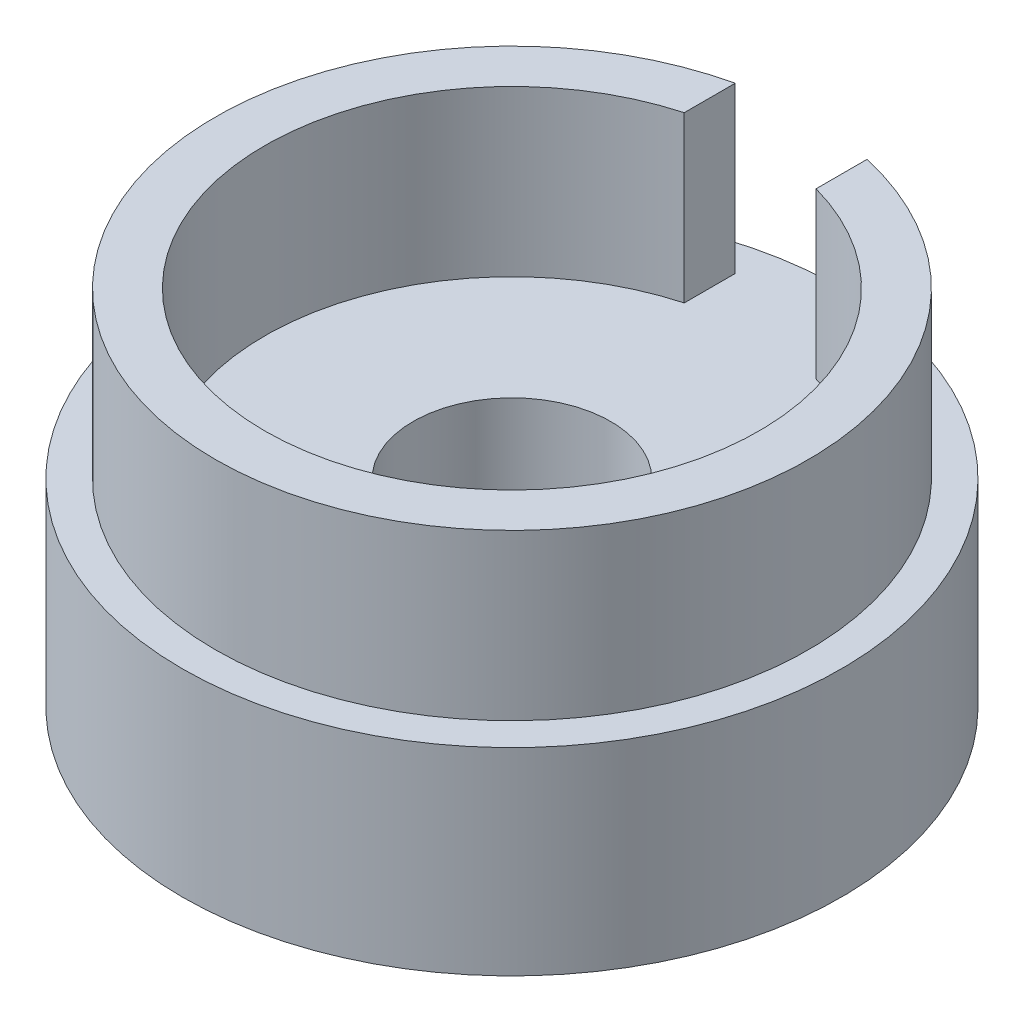
ISO-10303-21;
HEADER;
FILE_DESCRIPTION(('STEP AP214'),'2;1');
FILE_NAME('part.step','',(''),(''),'','','');
FILE_SCHEMA(('AUTOMOTIVE_DESIGN { 1 0 10303 214 1 1 1 1 }'));
ENDSEC;
DATA;
#1=APPLICATION_CONTEXT('core data for automotive mechanical design processes');
#2=APPLICATION_PROTOCOL_DEFINITION('international standard','automotive_design',2000,#1);
#3=PRODUCT_CONTEXT('',#1,'mechanical');
#4=PRODUCT('Part','Part','',(#3));
#5=PRODUCT_RELATED_PRODUCT_CATEGORY('part','',(#4));
#6=PRODUCT_DEFINITION_FORMATION('','',#4);
#7=PRODUCT_DEFINITION_CONTEXT('part definition',#1,'design');
#8=PRODUCT_DEFINITION('design','',#6,#7);
#9=PRODUCT_DEFINITION_SHAPE('','',#8);
#10=(LENGTH_UNIT() NAMED_UNIT(*) SI_UNIT(.MILLI.,.METRE.));
#11=(NAMED_UNIT(*) PLANE_ANGLE_UNIT() SI_UNIT($,.RADIAN.));
#12=(NAMED_UNIT(*) SI_UNIT($,.STERADIAN.) SOLID_ANGLE_UNIT());
#13=UNCERTAINTY_MEASURE_WITH_UNIT(LENGTH_MEASURE(1.E-05),#10,'distance_accuracy_value','');
#14=(GEOMETRIC_REPRESENTATION_CONTEXT(3) GLOBAL_UNCERTAINTY_ASSIGNED_CONTEXT((#13)) GLOBAL_UNIT_ASSIGNED_CONTEXT((#10,
#11,#12)) REPRESENTATION_CONTEXT('',''));
#15=CARTESIAN_POINT('',(0.,0.,0.));
#16=DIRECTION('',(0.,0.,1.));
#17=DIRECTION('',(1.,0.,0.));
#18=AXIS2_PLACEMENT_3D('',#15,#16,#17);
#19=CARTESIAN_POINT('',(0.,3.,0.));
#20=DIRECTION('',(0.,1.,0.));
#21=DIRECTION('',(0.,0.,1.));
#22=AXIS2_PLACEMENT_3D('',#19,#20,#21);
#23=PLANE('',#22);
#24=CARTESIAN_POINT('',(0.,3.,0.));
#25=DIRECTION('',(0.,1.,0.));
#26=DIRECTION('',(0.,0.,1.));
#27=AXIS2_PLACEMENT_3D('',#24,#25,#26);
#28=CIRCLE('',#27,5.);
#29=CARTESIAN_POINT('',(0.,3.,5.));
#30=VERTEX_POINT('',#29);
#31=EDGE_CURVE('E104',#30,#30,#28,.T.);
#32=ORIENTED_EDGE('',*,*,#31,.T.);
#33=EDGE_LOOP('',(#32));
#34=FACE_BOUND('',#33,.T.);
#35=DIRECTION('',(0.,0.,1.));
#36=VECTOR('',#35,1.);
#37=CARTESIAN_POINT('',(1.,3.,-3.61420807370024));
#38=LINE('',#37,#36);
#39=CARTESIAN_POINT('',(1.,3.,-4.38748219369606));
#40=VERTEX_POINT('',#39);
#41=CARTESIAN_POINT('',(1.,3.,-3.61420807370024));
#42=VERTEX_POINT('',#41);
#43=EDGE_CURVE('E137',#40,#42,#38,.T.);
#44=ORIENTED_EDGE('',*,*,#43,.F.);
#45=CARTESIAN_POINT('',(0.,3.,0.));
#46=DIRECTION('',(0.,1.,0.));
#47=DIRECTION('',(0.,0.,1.));
#48=AXIS2_PLACEMENT_3D('',#45,#46,#47);
#49=CIRCLE('',#48,4.5);
#50=CARTESIAN_POINT('',(-1.,3.,-4.38748219369606));
#51=VERTEX_POINT('',#50);
#52=EDGE_CURVE('E88',#51,#40,#49,.T.);
#53=ORIENTED_EDGE('',*,*,#52,.F.);
#54=DIRECTION('',(0.,0.,-1.));
#55=VECTOR('',#54,1.);
#56=CARTESIAN_POINT('',(-1.,3.,-3.61420807370024));
#57=LINE('',#56,#55);
#58=CARTESIAN_POINT('',(-1.,3.,-3.61420807370024));
#59=VERTEX_POINT('',#58);
#60=EDGE_CURVE('E139',#59,#51,#57,.T.);
#61=ORIENTED_EDGE('',*,*,#60,.F.);
#62=CARTESIAN_POINT('',(0.,3.,0.));
#63=DIRECTION('',(0.,1.,0.));
#64=DIRECTION('',(0.,0.,1.));
#65=AXIS2_PLACEMENT_3D('',#62,#63,#64);
#66=CIRCLE('',#65,3.75);
#67=EDGE_CURVE('E40',#42,#59,#66,.F.);
#68=ORIENTED_EDGE('',*,*,#67,.F.);
#69=EDGE_LOOP('',(#44,#53,#61,#68));
#70=FACE_BOUND('',#69,.T.);
#71=CARTESIAN_POINT('',(0.,3.,0.));
#72=DIRECTION('',(0.,1.,0.));
#73=DIRECTION('',(0.,0.,1.));
#74=AXIS2_PLACEMENT_3D('',#71,#72,#73);
#75=CIRCLE('',#74,1.5);
#76=CARTESIAN_POINT('',(0.,3.,1.5));
#77=VERTEX_POINT('',#76);
#78=EDGE_CURVE('E98',#77,#77,#75,.T.);
#79=ORIENTED_EDGE('',*,*,#78,.F.);
#80=EDGE_LOOP('',(#79));
#81=FACE_BOUND('',#80,.T.);
#82=ADVANCED_FACE('F32',(#34,#70,#81),#23,.T.);
#83=CARTESIAN_POINT('',(0.,0.,0.));
#84=DIRECTION('',(0.,1.,0.));
#85=DIRECTION('',(0.,0.,1.));
#86=AXIS2_PLACEMENT_3D('',#83,#84,#85);
#87=PLANE('',#86);
#88=CARTESIAN_POINT('',(0.,0.,0.));
#89=DIRECTION('',(0.,1.,0.));
#90=DIRECTION('',(0.,0.,1.));
#91=AXIS2_PLACEMENT_3D('',#88,#89,#90);
#92=CIRCLE('',#91,5.);
#93=CARTESIAN_POINT('',(0.,0.,5.));
#94=VERTEX_POINT('',#93);
#95=EDGE_CURVE('E101',#94,#94,#92,.T.);
#96=ORIENTED_EDGE('',*,*,#95,.F.);
#97=EDGE_LOOP('',(#96));
#98=FACE_BOUND('',#97,.T.);
#99=CARTESIAN_POINT('',(0.,0.,0.));
#100=DIRECTION('',(0.,1.,0.));
#101=DIRECTION('',(0.,0.,1.));
#102=AXIS2_PLACEMENT_3D('',#99,#100,#101);
#103=CIRCLE('',#102,1.5);
#104=CARTESIAN_POINT('',(0.,0.,1.5));
#105=VERTEX_POINT('',#104);
#106=EDGE_CURVE('E90',#105,#105,#103,.T.);
#107=ORIENTED_EDGE('',*,*,#106,.T.);
#108=EDGE_LOOP('',(#107));
#109=FACE_BOUND('',#108,.T.);
#110=ADVANCED_FACE('F111',(#98,#109),#87,.F.);
#111=CARTESIAN_POINT('',(0.,3.,0.));
#112=DIRECTION('',(0.,-1.,0.));
#113=DIRECTION('',(0.,0.,-1.));
#114=AXIS2_PLACEMENT_3D('',#111,#112,#113);
#115=CYLINDRICAL_SURFACE('',#114,5.);
#116=ORIENTED_EDGE('',*,*,#31,.F.);
#117=EDGE_LOOP('',(#116));
#118=FACE_BOUND('',#117,.T.);
#119=ORIENTED_EDGE('',*,*,#95,.T.);
#120=EDGE_LOOP('',(#119));
#121=FACE_BOUND('',#120,.T.);
#122=ADVANCED_FACE('F34',(#118,#121),#115,.T.);
#123=CARTESIAN_POINT('',(0.,3.,0.));
#124=DIRECTION('',(0.,-1.,0.));
#125=DIRECTION('',(0.,0.,-1.));
#126=AXIS2_PLACEMENT_3D('',#123,#124,#125);
#127=CYLINDRICAL_SURFACE('',#126,1.5);
#128=ORIENTED_EDGE('',*,*,#78,.T.);
#129=EDGE_LOOP('',(#128));
#130=FACE_BOUND('',#129,.T.);
#131=ORIENTED_EDGE('',*,*,#106,.F.);
#132=EDGE_LOOP('',(#131));
#133=FACE_BOUND('',#132,.T.);
#134=ADVANCED_FACE('F116',(#130,#133),#127,.F.);
#135=CARTESIAN_POINT('',(0.,5.5,0.));
#136=DIRECTION('',(0.,-1.,0.));
#137=DIRECTION('',(0.,0.,-1.));
#138=AXIS2_PLACEMENT_3D('',#135,#136,#137);
#139=CYLINDRICAL_SURFACE('',#138,3.75);
#140=DIRECTION('',(0.,1.,0.));
#141=VECTOR('',#140,1.);
#142=CARTESIAN_POINT('',(1.,0.566808831390843,-3.61420807370024));
#143=LINE('',#142,#141);
#144=CARTESIAN_POINT('',(1.,5.5,-3.61420807370024));
#145=VERTEX_POINT('',#144);
#146=EDGE_CURVE('E84',#42,#145,#143,.T.);
#147=ORIENTED_EDGE('',*,*,#146,.F.);
#148=ORIENTED_EDGE('',*,*,#67,.T.);
#149=DIRECTION('',(0.,1.,0.));
#150=VECTOR('',#149,1.);
#151=CARTESIAN_POINT('',(-1.,0.566808831390843,-3.61420807370024));
#152=LINE('',#151,#150);
#153=CARTESIAN_POINT('',(-1.,5.5,-3.61420807370024));
#154=VERTEX_POINT('',#153);
#155=EDGE_CURVE('E72',#59,#154,#152,.T.);
#156=ORIENTED_EDGE('',*,*,#155,.T.);
#157=CARTESIAN_POINT('',(0.,5.5,0.));
#158=DIRECTION('',(0.,1.,0.));
#159=DIRECTION('',(0.,0.,1.));
#160=AXIS2_PLACEMENT_3D('',#157,#158,#159);
#161=CIRCLE('',#160,3.75);
#162=EDGE_CURVE('E82',#154,#145,#161,.T.);
#163=ORIENTED_EDGE('',*,*,#162,.T.);
#164=EDGE_LOOP('',(#147,#148,#156,#163));
#165=FACE_BOUND('',#164,.T.);
#166=ADVANCED_FACE('F81',(#165),#139,.F.);
#167=CARTESIAN_POINT('',(0.,5.5,0.));
#168=DIRECTION('',(0.,-1.,0.));
#169=DIRECTION('',(0.,0.,-1.));
#170=AXIS2_PLACEMENT_3D('',#167,#168,#169);
#171=CYLINDRICAL_SURFACE('',#170,4.5);
#172=ORIENTED_EDGE('',*,*,#52,.T.);
#173=DIRECTION('',(0.,-1.,0.));
#174=VECTOR('',#173,1.);
#175=CARTESIAN_POINT('',(1.,5.5,-4.38748219369606));
#176=LINE('',#175,#174);
#177=CARTESIAN_POINT('',(1.,5.5,-4.38748219369606));
#178=VERTEX_POINT('',#177);
#179=EDGE_CURVE('E93',#40,#178,#176,.F.);
#180=ORIENTED_EDGE('',*,*,#179,.T.);
#181=CARTESIAN_POINT('',(0.,5.5,0.));
#182=DIRECTION('',(0.,1.,0.));
#183=DIRECTION('',(0.,0.,1.));
#184=AXIS2_PLACEMENT_3D('',#181,#182,#183);
#185=CIRCLE('',#184,4.5);
#186=CARTESIAN_POINT('',(-1.,5.5,-4.38748219369606));
#187=VERTEX_POINT('',#186);
#188=EDGE_CURVE('E87',#187,#178,#185,.T.);
#189=ORIENTED_EDGE('',*,*,#188,.F.);
#190=DIRECTION('',(0.,-1.,0.));
#191=VECTOR('',#190,1.);
#192=CARTESIAN_POINT('',(-1.,5.5,-4.38748219369606));
#193=LINE('',#192,#191);
#194=EDGE_CURVE('E46',#187,#51,#193,.T.);
#195=ORIENTED_EDGE('',*,*,#194,.T.);
#196=EDGE_LOOP('',(#172,#180,#189,#195));
#197=FACE_BOUND('',#196,.T.);
#198=ADVANCED_FACE('F124',(#197),#171,.T.);
#199=CARTESIAN_POINT('',(0.,5.5,0.));
#200=DIRECTION('',(0.,1.,0.));
#201=DIRECTION('',(0.,0.,1.));
#202=AXIS2_PLACEMENT_3D('',#199,#200,#201);
#203=PLANE('',#202);
#204=DIRECTION('',(0.,0.,-1.));
#205=VECTOR('',#204,1.);
#206=CARTESIAN_POINT('',(1.,5.5,-3.61420807370024));
#207=LINE('',#206,#205);
#208=EDGE_CURVE('E54',#145,#178,#207,.T.);
#209=ORIENTED_EDGE('',*,*,#208,.F.);
#210=ORIENTED_EDGE('',*,*,#162,.F.);
#211=DIRECTION('',(0.,0.,1.));
#212=VECTOR('',#211,1.);
#213=CARTESIAN_POINT('',(-1.,5.5,0.));
#214=LINE('',#213,#212);
#215=EDGE_CURVE('E11',#187,#154,#214,.T.);
#216=ORIENTED_EDGE('',*,*,#215,.F.);
#217=ORIENTED_EDGE('',*,*,#188,.T.);
#218=EDGE_LOOP('',(#209,#210,#216,#217));
#219=FACE_BOUND('',#218,.T.);
#220=ADVANCED_FACE('F86',(#219),#203,.T.);
#221=CARTESIAN_POINT('',(1.,0.566808831390843,-3.61420807370024));
#222=DIRECTION('',(1.,0.,0.));
#223=DIRECTION('',(0.,0.,-1.));
#224=AXIS2_PLACEMENT_3D('',#221,#222,#223);
#225=PLANE('',#224);
#226=ORIENTED_EDGE('',*,*,#43,.T.);
#227=ORIENTED_EDGE('',*,*,#146,.T.);
#228=ORIENTED_EDGE('',*,*,#208,.T.);
#229=ORIENTED_EDGE('',*,*,#179,.F.);
#230=EDGE_LOOP('',(#226,#227,#228,#229));
#231=FACE_BOUND('',#230,.T.);
#232=ADVANCED_FACE('F145',(#231),#225,.F.);
#233=CARTESIAN_POINT('',(-1.,0.566808831390843,-3.61420807370024));
#234=DIRECTION('',(-1.,0.,0.));
#235=DIRECTION('',(0.,0.,1.));
#236=AXIS2_PLACEMENT_3D('',#233,#234,#235);
#237=PLANE('',#236);
#238=ORIENTED_EDGE('',*,*,#215,.T.);
#239=ORIENTED_EDGE('',*,*,#155,.F.);
#240=ORIENTED_EDGE('',*,*,#60,.T.);
#241=ORIENTED_EDGE('',*,*,#194,.F.);
#242=EDGE_LOOP('',(#238,#239,#240,#241));
#243=FACE_BOUND('',#242,.T.);
#244=ADVANCED_FACE('F71',(#243),#237,.F.);
#245=CLOSED_SHELL('',(#82,#110,#122,#134,#166,#198,#220,#232,#244));
#246=MANIFOLD_SOLID_BREP('B2',#245);
#247=ADVANCED_BREP_SHAPE_REPRESENTATION('',(#18,#246),#14);
#248=SHAPE_DEFINITION_REPRESENTATION(#9,#247);
ENDSEC;
END-ISO-10303-21;
